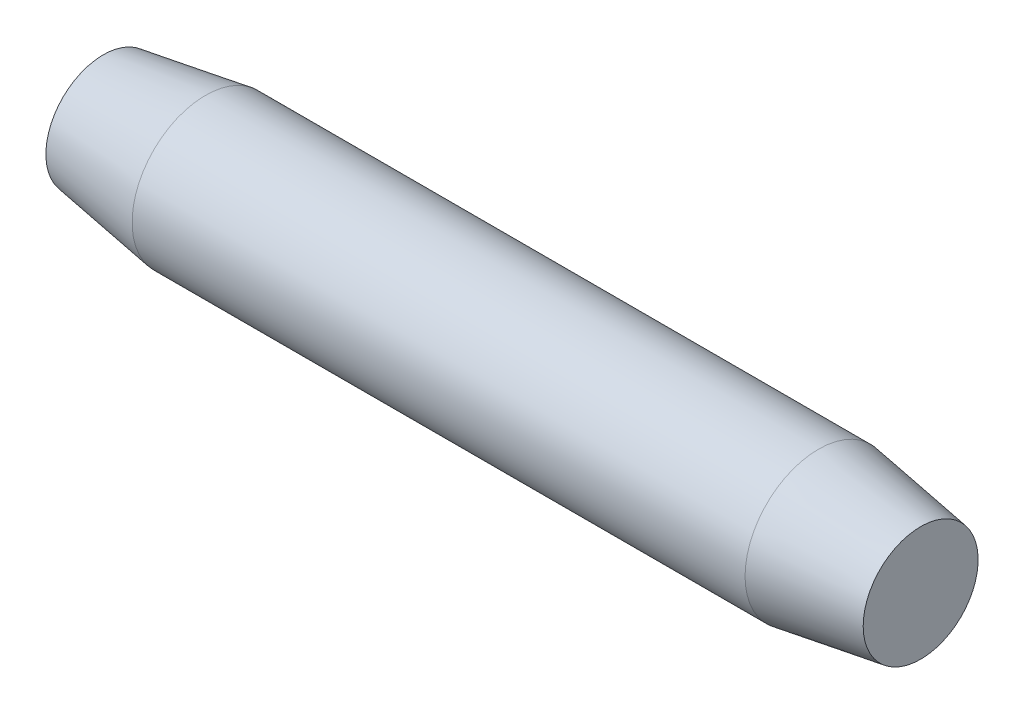
ISO-10303-21;
HEADER;
FILE_DESCRIPTION(('STEP AP214'),'2;1');
FILE_NAME('part.step','',(''),(''),'','','');
FILE_SCHEMA(('AUTOMOTIVE_DESIGN { 1 0 10303 214 1 1 1 1 }'));
ENDSEC;
DATA;
#1=APPLICATION_CONTEXT('core data for automotive mechanical design processes');
#2=APPLICATION_PROTOCOL_DEFINITION('international standard','automotive_design',2000,#1);
#3=PRODUCT_CONTEXT('',#1,'mechanical');
#4=PRODUCT('Part','Part','',(#3));
#5=PRODUCT_RELATED_PRODUCT_CATEGORY('part','',(#4));
#6=PRODUCT_DEFINITION_FORMATION('','',#4);
#7=PRODUCT_DEFINITION_CONTEXT('part definition',#1,'design');
#8=PRODUCT_DEFINITION('design','',#6,#7);
#9=PRODUCT_DEFINITION_SHAPE('','',#8);
#10=(LENGTH_UNIT() NAMED_UNIT(*) SI_UNIT(.MILLI.,.METRE.));
#11=(NAMED_UNIT(*) PLANE_ANGLE_UNIT() SI_UNIT($,.RADIAN.));
#12=(NAMED_UNIT(*) SI_UNIT($,.STERADIAN.) SOLID_ANGLE_UNIT());
#13=UNCERTAINTY_MEASURE_WITH_UNIT(LENGTH_MEASURE(1.E-05),#10,'distance_accuracy_value','');
#14=(GEOMETRIC_REPRESENTATION_CONTEXT(3) GLOBAL_UNCERTAINTY_ASSIGNED_CONTEXT((#13)) GLOBAL_UNIT_ASSIGNED_CONTEXT((#10,
#11,#12)) REPRESENTATION_CONTEXT('',''));
#15=CARTESIAN_POINT('',(0.,0.,0.));
#16=DIRECTION('',(0.,0.,1.));
#17=DIRECTION('',(1.,0.,0.));
#18=AXIS2_PLACEMENT_3D('',#15,#16,#17);
#19=CARTESIAN_POINT('',(0.,0.,0.));
#20=DIRECTION('',(1.,0.,0.));
#21=DIRECTION('',(0.,0.,-1.));
#22=AXIS2_PLACEMENT_3D('',#19,#20,#21);
#23=PLANE('',#22);
#24=CARTESIAN_POINT('',(-1.80411241501588E-13,0.,0.));
#25=DIRECTION('',(1.,0.,0.));
#26=DIRECTION('',(0.,0.,-1.));
#27=AXIS2_PLACEMENT_3D('',#24,#25,#26);
#28=CIRCLE('',#27,14.2938500000012);
#29=CARTESIAN_POINT('',(-1.80411241501588E-13,0.,-14.2938500000012));
#30=VERTEX_POINT('',#29);
#31=EDGE_CURVE('E17',#30,#30,#28,.T.);
#32=ORIENTED_EDGE('',*,*,#31,.F.);
#33=EDGE_LOOP('',(#32));
#34=FACE_BOUND('',#33,.T.);
#35=ADVANCED_FACE('F14',(#34),#23,.F.);
#36=CARTESIAN_POINT('',(203.2,0.,0.));
#37=DIRECTION('',(1.,0.,0.));
#38=DIRECTION('',(0.,0.,-1.));
#39=AXIS2_PLACEMENT_3D('',#36,#37,#38);
#40=PLANE('',#39);
#41=CARTESIAN_POINT('',(203.2,0.,0.));
#42=DIRECTION('',(-1.,0.,0.));
#43=DIRECTION('',(0.,0.,1.));
#44=AXIS2_PLACEMENT_3D('',#41,#42,#43);
#45=CIRCLE('',#44,14.2875000000024);
#46=CARTESIAN_POINT('',(203.2,0.,14.2875000000024));
#47=VERTEX_POINT('',#46);
#48=EDGE_CURVE('E26',#47,#47,#45,.T.);
#49=ORIENTED_EDGE('',*,*,#48,.F.);
#50=EDGE_LOOP('',(#49));
#51=FACE_BOUND('',#50,.T.);
#52=ADVANCED_FACE('F37',(#51),#40,.T.);
#53=CARTESIAN_POINT('',(25.3999999999999,0.,0.));
#54=DIRECTION('',(1.,0.,0.));
#55=DIRECTION('',(0.,0.,-1.));
#56=AXIS2_PLACEMENT_3D('',#53,#54,#55);
#57=CONICAL_SURFACE('',#56,18.2562500000003,0.15475269067799);
#58=CARTESIAN_POINT('',(25.4,0.,0.));
#59=DIRECTION('',(1.,0.,0.));
#60=DIRECTION('',(0.,0.,-1.));
#61=AXIS2_PLACEMENT_3D('',#58,#59,#60);
#62=CIRCLE('',#61,18.25625);
#63=CARTESIAN_POINT('',(25.4,0.,-18.25625));
#64=VERTEX_POINT('',#63);
#65=EDGE_CURVE('E21',#64,#64,#62,.T.);
#66=ORIENTED_EDGE('',*,*,#65,.F.);
#67=EDGE_LOOP('',(#66));
#68=FACE_BOUND('',#67,.T.);
#69=ORIENTED_EDGE('',*,*,#31,.T.);
#70=EDGE_LOOP('',(#69));
#71=FACE_BOUND('',#70,.T.);
#72=ADVANCED_FACE('F34',(#68,#71),#57,.T.);
#73=CARTESIAN_POINT('',(177.8,0.,0.));
#74=DIRECTION('',(-1.,0.,0.));
#75=DIRECTION('',(0.,0.,1.));
#76=AXIS2_PLACEMENT_3D('',#73,#74,#75);
#77=CONICAL_SURFACE('',#76,18.2562500000016,0.154996741923907);
#78=CARTESIAN_POINT('',(177.8,0.,0.));
#79=DIRECTION('',(1.,0.,0.));
#80=DIRECTION('',(0.,0.,-1.));
#81=AXIS2_PLACEMENT_3D('',#78,#79,#80);
#82=CIRCLE('',#81,18.25625);
#83=CARTESIAN_POINT('',(177.8,0.,-18.25625));
#84=VERTEX_POINT('',#83);
#85=EDGE_CURVE('E10',#84,#84,#82,.F.);
#86=ORIENTED_EDGE('',*,*,#85,.F.);
#87=EDGE_LOOP('',(#86));
#88=FACE_BOUND('',#87,.T.);
#89=ORIENTED_EDGE('',*,*,#48,.T.);
#90=EDGE_LOOP('',(#89));
#91=FACE_BOUND('',#90,.T.);
#92=ADVANCED_FACE('F45',(#88,#91),#77,.T.);
#93=CARTESIAN_POINT('',(0.,0.,0.));
#94=DIRECTION('',(1.,0.,0.));
#95=DIRECTION('',(0.,0.,-1.));
#96=AXIS2_PLACEMENT_3D('',#93,#94,#95);
#97=CYLINDRICAL_SURFACE('',#96,18.25625);
#98=ORIENTED_EDGE('',*,*,#65,.T.);
#99=EDGE_LOOP('',(#98));
#100=FACE_BOUND('',#99,.T.);
#101=ORIENTED_EDGE('',*,*,#85,.T.);
#102=EDGE_LOOP('',(#101));
#103=FACE_BOUND('',#102,.T.);
#104=ADVANCED_FACE('F43',(#100,#103),#97,.T.);
#105=CLOSED_SHELL('',(#35,#52,#72,#92,#104));
#106=MANIFOLD_SOLID_BREP('B1',#105);
#107=ADVANCED_BREP_SHAPE_REPRESENTATION('',(#18,#106),#14);
#108=SHAPE_DEFINITION_REPRESENTATION(#9,#107);
ENDSEC;
END-ISO-10303-21;
